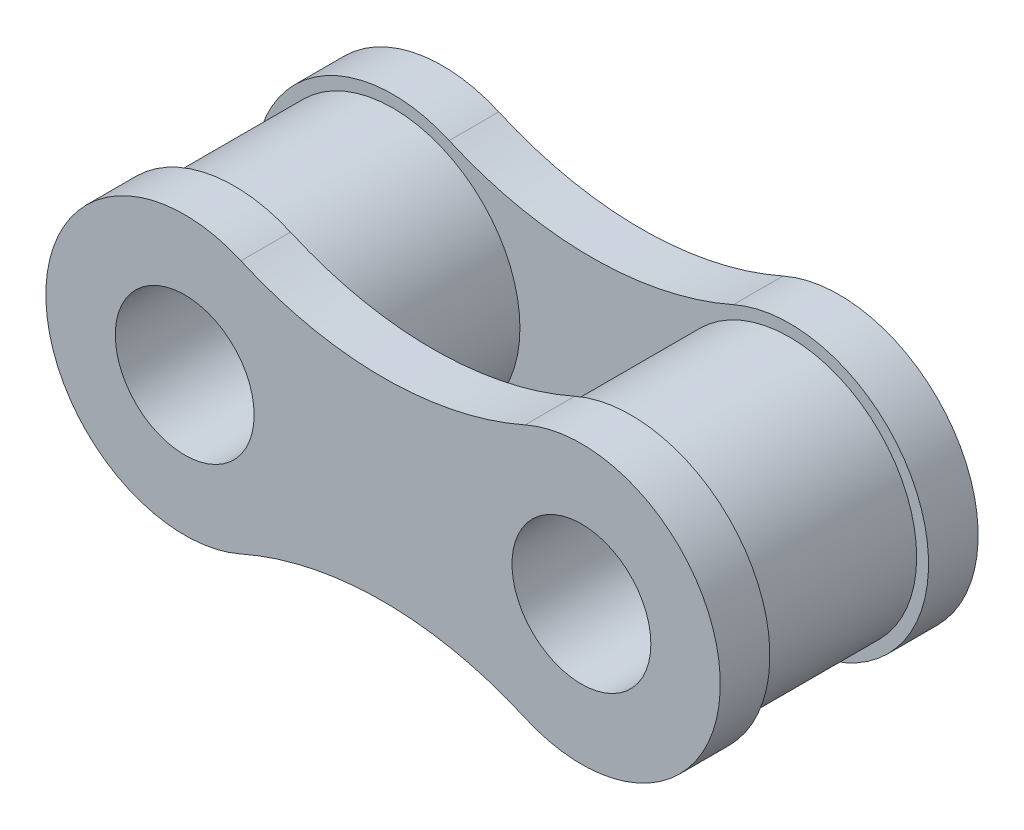
ISO-10303-21;
HEADER;
FILE_DESCRIPTION(('STEP AP214'),'2;1');
FILE_NAME('part.step','',(''),(''),'','','');
FILE_SCHEMA(('AUTOMOTIVE_DESIGN { 1 0 10303 214 1 1 1 1 }'));
ENDSEC;
DATA;
#1=APPLICATION_CONTEXT('core data for automotive mechanical design processes');
#2=APPLICATION_PROTOCOL_DEFINITION('international standard','automotive_design',2000,#1);
#3=PRODUCT_CONTEXT('',#1,'mechanical');
#4=PRODUCT('Part','Part','',(#3));
#5=PRODUCT_RELATED_PRODUCT_CATEGORY('part','',(#4));
#6=PRODUCT_DEFINITION_FORMATION('','',#4);
#7=PRODUCT_DEFINITION_CONTEXT('part definition',#1,'design');
#8=PRODUCT_DEFINITION('design','',#6,#7);
#9=PRODUCT_DEFINITION_SHAPE('','',#8);
#10=(LENGTH_UNIT() NAMED_UNIT(*) SI_UNIT(.MILLI.,.METRE.));
#11=(NAMED_UNIT(*) PLANE_ANGLE_UNIT() SI_UNIT($,.RADIAN.));
#12=(NAMED_UNIT(*) SI_UNIT($,.STERADIAN.) SOLID_ANGLE_UNIT());
#13=UNCERTAINTY_MEASURE_WITH_UNIT(LENGTH_MEASURE(1.E-05),#10,'distance_accuracy_value','');
#14=(GEOMETRIC_REPRESENTATION_CONTEXT(3) GLOBAL_UNCERTAINTY_ASSIGNED_CONTEXT((#13)) GLOBAL_UNIT_ASSIGNED_CONTEXT((#10,
#11,#12)) REPRESENTATION_CONTEXT('',''));
#15=CARTESIAN_POINT('',(0.,0.,0.));
#16=DIRECTION('',(0.,0.,1.));
#17=DIRECTION('',(1.,0.,0.));
#18=AXIS2_PLACEMENT_3D('',#15,#16,#17);
#19=CARTESIAN_POINT('',(11.90625,8.95788932140425,-3.175));
#20=DIRECTION('',(0.,0.,-1.));
#21=DIRECTION('',(1.,0.,0.));
#22=AXIS2_PLACEMENT_3D('',#19,#20,#21);
#23=PLANE('',#22);
#24=CARTESIAN_POINT('',(0.,0.,-3.17499999999882));
#25=DIRECTION('',(0.,0.,-1.));
#26=DIRECTION('',(-1.,0.,0.));
#27=AXIS2_PLACEMENT_3D('',#24,#25,#26);
#28=CIRCLE('',#27,3.81);
#29=CARTESIAN_POINT('',(-3.81,0.,-3.17499999999882));
#30=VERTEX_POINT('',#29);
#31=EDGE_CURVE('E191',#30,#30,#28,.F.);
#32=ORIENTED_EDGE('',*,*,#31,.F.);
#33=EDGE_LOOP('',(#32));
#34=FACE_BOUND('',#33,.T.);
#35=CARTESIAN_POINT('',(7.9375,17.9157786428085,-3.175));
#36=DIRECTION('',(0.,0.,-1.));
#37=DIRECTION('',(1.,0.,0.));
#38=AXIS2_PLACEMENT_3D('',#35,#36,#37);
#39=CIRCLE('',#38,14.0391328905718);
#40=CARTESIAN_POINT('',(13.6243303079972,5.08000000000001,-3.175));
#41=VERTEX_POINT('',#40);
#42=CARTESIAN_POINT('',(2.25066969200279,5.08000000000001,-3.175));
#43=VERTEX_POINT('',#42);
#44=EDGE_CURVE('E167',#41,#43,#39,.T.);
#45=ORIENTED_EDGE('',*,*,#44,.T.);
#46=CARTESIAN_POINT('',(0.,0.,-3.175));
#47=DIRECTION('',(0.,0.,1.));
#48=DIRECTION('',(1.,0.,0.));
#49=AXIS2_PLACEMENT_3D('',#46,#47,#48);
#50=CIRCLE('',#49,5.55625);
#51=CARTESIAN_POINT('',(2.25066969200279,-5.08000000000001,-3.175));
#52=VERTEX_POINT('',#51);
#53=EDGE_CURVE('E179',#43,#52,#50,.T.);
#54=ORIENTED_EDGE('',*,*,#53,.T.);
#55=CARTESIAN_POINT('',(7.9375,-17.9157786428085,-3.175));
#56=DIRECTION('',(0.,0.,-1.));
#57=DIRECTION('',(-1.,0.,0.));
#58=AXIS2_PLACEMENT_3D('',#55,#56,#57);
#59=CIRCLE('',#58,14.0391328905718);
#60=CARTESIAN_POINT('',(13.6243303079972,-5.08,-3.175));
#61=VERTEX_POINT('',#60);
#62=EDGE_CURVE('E182',#52,#61,#59,.T.);
#63=ORIENTED_EDGE('',*,*,#62,.T.);
#64=CARTESIAN_POINT('',(15.875,0.,-3.175));
#65=DIRECTION('',(0.,0.,1.));
#66=DIRECTION('',(1.,0.,0.));
#67=AXIS2_PLACEMENT_3D('',#64,#65,#66);
#68=CIRCLE('',#67,5.55625);
#69=EDGE_CURVE('E171',#61,#41,#68,.T.);
#70=ORIENTED_EDGE('',*,*,#69,.T.);
#71=EDGE_LOOP('',(#45,#54,#63,#70));
#72=FACE_BOUND('',#71,.T.);
#73=CARTESIAN_POINT('',(15.875,0.,-3.17499999999882));
#74=DIRECTION('',(0.,0.,-1.));
#75=DIRECTION('',(-1.,0.,0.));
#76=AXIS2_PLACEMENT_3D('',#73,#74,#75);
#77=CIRCLE('',#76,3.81);
#78=CARTESIAN_POINT('',(12.065,0.,-3.17499999999882));
#79=VERTEX_POINT('',#78);
#80=EDGE_CURVE('E13',#79,#79,#77,.F.);
#81=ORIENTED_EDGE('',*,*,#80,.F.);
#82=EDGE_LOOP('',(#81));
#83=FACE_BOUND('',#82,.T.);
#84=ADVANCED_FACE('F53',(#34,#72,#83),#23,.F.);
#85=CARTESIAN_POINT('',(11.90625,8.95788932140425,3.175));
#86=DIRECTION('',(0.,0.,1.));
#87=DIRECTION('',(1.,0.,0.));
#88=AXIS2_PLACEMENT_3D('',#85,#86,#87);
#89=PLANE('',#88);
#90=CARTESIAN_POINT('',(0.,0.,3.17499999999882));
#91=DIRECTION('',(0.,0.,1.));
#92=DIRECTION('',(1.,0.,0.));
#93=AXIS2_PLACEMENT_3D('',#90,#91,#92);
#94=CIRCLE('',#93,3.81);
#95=CARTESIAN_POINT('',(3.81,0.,3.17499999999882));
#96=VERTEX_POINT('',#95);
#97=EDGE_CURVE('E153',#96,#96,#94,.T.);
#98=ORIENTED_EDGE('',*,*,#97,.T.);
#99=EDGE_LOOP('',(#98));
#100=FACE_BOUND('',#99,.T.);
#101=CARTESIAN_POINT('',(7.9375,17.9157786428085,3.175));
#102=DIRECTION('',(0.,0.,-1.));
#103=DIRECTION('',(1.,0.,0.));
#104=AXIS2_PLACEMENT_3D('',#101,#102,#103);
#105=CIRCLE('',#104,14.0391328905718);
#106=CARTESIAN_POINT('',(13.6243303079972,5.08000000000001,3.175));
#107=VERTEX_POINT('',#106);
#108=CARTESIAN_POINT('',(2.25066969200279,5.08000000000001,3.175));
#109=VERTEX_POINT('',#108);
#110=EDGE_CURVE('E152',#107,#109,#105,.T.);
#111=ORIENTED_EDGE('',*,*,#110,.F.);
#112=CARTESIAN_POINT('',(15.875,0.,3.175));
#113=DIRECTION('',(0.,0.,1.));
#114=DIRECTION('',(1.,0.,0.));
#115=AXIS2_PLACEMENT_3D('',#112,#113,#114);
#116=CIRCLE('',#115,5.55625);
#117=CARTESIAN_POINT('',(13.6243303079972,-5.08,3.175));
#118=VERTEX_POINT('',#117);
#119=EDGE_CURVE('E148',#118,#107,#116,.T.);
#120=ORIENTED_EDGE('',*,*,#119,.F.);
#121=CARTESIAN_POINT('',(7.9375,-17.9157786428085,3.175));
#122=DIRECTION('',(0.,0.,-1.));
#123=DIRECTION('',(-1.,0.,0.));
#124=AXIS2_PLACEMENT_3D('',#121,#122,#123);
#125=CIRCLE('',#124,14.0391328905718);
#126=CARTESIAN_POINT('',(2.25066969200279,-5.08000000000001,3.175));
#127=VERTEX_POINT('',#126);
#128=EDGE_CURVE('E272',#127,#118,#125,.T.);
#129=ORIENTED_EDGE('',*,*,#128,.F.);
#130=CARTESIAN_POINT('',(0.,0.,3.175));
#131=DIRECTION('',(0.,0.,1.));
#132=DIRECTION('',(1.,0.,0.));
#133=AXIS2_PLACEMENT_3D('',#130,#131,#132);
#134=CIRCLE('',#133,5.55625);
#135=EDGE_CURVE('E270',#109,#127,#134,.T.);
#136=ORIENTED_EDGE('',*,*,#135,.F.);
#137=EDGE_LOOP('',(#111,#120,#129,#136));
#138=FACE_BOUND('',#137,.T.);
#139=CARTESIAN_POINT('',(15.875,0.,3.17499999999882));
#140=DIRECTION('',(0.,0.,1.));
#141=DIRECTION('',(1.,0.,0.));
#142=AXIS2_PLACEMENT_3D('',#139,#140,#141);
#143=CIRCLE('',#142,3.81);
#144=CARTESIAN_POINT('',(19.685,0.,3.17499999999882));
#145=VERTEX_POINT('',#144);
#146=EDGE_CURVE('E62',#145,#145,#143,.F.);
#147=ORIENTED_EDGE('',*,*,#146,.F.);
#148=EDGE_LOOP('',(#147));
#149=FACE_BOUND('',#148,.T.);
#150=ADVANCED_FACE('F198',(#100,#138,#149),#89,.F.);
#151=CARTESIAN_POINT('',(11.90625,8.95788932140425,-5.159375));
#152=DIRECTION('',(0.,0.,-1.));
#153=DIRECTION('',(1.,0.,0.));
#154=AXIS2_PLACEMENT_3D('',#151,#152,#153);
#155=PLANE('',#154);
#156=CARTESIAN_POINT('',(0.,0.,-5.159375));
#157=DIRECTION('',(0.,0.,1.));
#158=DIRECTION('',(1.,0.,0.));
#159=AXIS2_PLACEMENT_3D('',#156,#157,#158);
#160=CIRCLE('',#159,2.778125);
#161=CARTESIAN_POINT('',(2.778125,0.,-5.159375));
#162=VERTEX_POINT('',#161);
#163=EDGE_CURVE('E164',#162,#162,#160,.T.);
#164=ORIENTED_EDGE('',*,*,#163,.T.);
#165=EDGE_LOOP('',(#164));
#166=FACE_BOUND('',#165,.T.);
#167=CARTESIAN_POINT('',(7.9375,17.9157786428085,-5.159375));
#168=DIRECTION('',(0.,0.,-1.));
#169=DIRECTION('',(1.,0.,0.));
#170=AXIS2_PLACEMENT_3D('',#167,#168,#169);
#171=CIRCLE('',#170,14.0391328905718);
#172=CARTESIAN_POINT('',(13.6243303079972,5.08000000000001,-5.159375));
#173=VERTEX_POINT('',#172);
#174=CARTESIAN_POINT('',(2.25066969200279,5.08000000000001,-5.159375));
#175=VERTEX_POINT('',#174);
#176=EDGE_CURVE('E168',#173,#175,#171,.T.);
#177=ORIENTED_EDGE('',*,*,#176,.F.);
#178=CARTESIAN_POINT('',(15.875,0.,-5.159375));
#179=DIRECTION('',(0.,0.,1.));
#180=DIRECTION('',(1.,0.,0.));
#181=AXIS2_PLACEMENT_3D('',#178,#179,#180);
#182=CIRCLE('',#181,5.55625);
#183=CARTESIAN_POINT('',(13.6243303079972,-5.08,-5.159375));
#184=VERTEX_POINT('',#183);
#185=EDGE_CURVE('E175',#184,#173,#182,.T.);
#186=ORIENTED_EDGE('',*,*,#185,.F.);
#187=CARTESIAN_POINT('',(7.9375,-17.9157786428085,-5.159375));
#188=DIRECTION('',(0.,0.,-1.));
#189=DIRECTION('',(-1.,0.,0.));
#190=AXIS2_PLACEMENT_3D('',#187,#188,#189);
#191=CIRCLE('',#190,14.0391328905718);
#192=CARTESIAN_POINT('',(2.25066969200279,-5.08000000000001,-5.159375));
#193=VERTEX_POINT('',#192);
#194=EDGE_CURVE('E173',#193,#184,#191,.T.);
#195=ORIENTED_EDGE('',*,*,#194,.F.);
#196=CARTESIAN_POINT('',(0.,0.,-5.159375));
#197=DIRECTION('',(0.,0.,1.));
#198=DIRECTION('',(1.,0.,0.));
#199=AXIS2_PLACEMENT_3D('',#196,#197,#198);
#200=CIRCLE('',#199,5.55625);
#201=EDGE_CURVE('E170',#175,#193,#200,.T.);
#202=ORIENTED_EDGE('',*,*,#201,.F.);
#203=EDGE_LOOP('',(#177,#186,#195,#202));
#204=FACE_BOUND('',#203,.T.);
#205=CARTESIAN_POINT('',(15.875,0.,-5.159375));
#206=DIRECTION('',(0.,0.,1.));
#207=DIRECTION('',(1.,0.,0.));
#208=AXIS2_PLACEMENT_3D('',#205,#206,#207);
#209=CIRCLE('',#208,2.778125);
#210=CARTESIAN_POINT('',(18.653125,0.,-5.159375));
#211=VERTEX_POINT('',#210);
#212=EDGE_CURVE('E156',#211,#211,#209,.T.);
#213=ORIENTED_EDGE('',*,*,#212,.T.);
#214=EDGE_LOOP('',(#213));
#215=FACE_BOUND('',#214,.T.);
#216=ADVANCED_FACE('F200',(#166,#204,#215),#155,.T.);
#217=CARTESIAN_POINT('',(7.9375,17.9157786428085,-5.159375));
#218=DIRECTION('',(0.,0.,1.));
#219=DIRECTION('',(-1.,0.,0.));
#220=AXIS2_PLACEMENT_3D('',#217,#218,#219);
#221=CYLINDRICAL_SURFACE('',#220,14.0391328905718);
#222=ORIENTED_EDGE('',*,*,#44,.F.);
#223=DIRECTION('',(0.,0.,1.));
#224=VECTOR('',#223,1.);
#225=CARTESIAN_POINT('',(13.6243303079972,5.08000000000001,-5.159375));
#226=LINE('',#225,#224);
#227=EDGE_CURVE('E70',#173,#41,#226,.T.);
#228=ORIENTED_EDGE('',*,*,#227,.F.);
#229=ORIENTED_EDGE('',*,*,#176,.T.);
#230=DIRECTION('',(0.,0.,1.));
#231=VECTOR('',#230,1.);
#232=CARTESIAN_POINT('',(2.25066969200279,5.08000000000001,-5.159375));
#233=LINE('',#232,#231);
#234=EDGE_CURVE('E98',#175,#43,#233,.T.);
#235=ORIENTED_EDGE('',*,*,#234,.T.);
#236=EDGE_LOOP('',(#222,#228,#229,#235));
#237=FACE_BOUND('',#236,.T.);
#238=ADVANCED_FACE('F55',(#237),#221,.F.);
#239=CARTESIAN_POINT('',(0.,0.,-5.159375));
#240=DIRECTION('',(0.,0.,1.));
#241=DIRECTION('',(-1.,0.,0.));
#242=AXIS2_PLACEMENT_3D('',#239,#240,#241);
#243=CYLINDRICAL_SURFACE('',#242,5.55625);
#244=ORIENTED_EDGE('',*,*,#53,.F.);
#245=ORIENTED_EDGE('',*,*,#234,.F.);
#246=ORIENTED_EDGE('',*,*,#201,.T.);
#247=DIRECTION('',(0.,0.,1.));
#248=VECTOR('',#247,1.);
#249=CARTESIAN_POINT('',(2.25066969200279,-5.08000000000001,-5.159375));
#250=LINE('',#249,#248);
#251=EDGE_CURVE('E188',#193,#52,#250,.T.);
#252=ORIENTED_EDGE('',*,*,#251,.T.);
#253=EDGE_LOOP('',(#244,#245,#246,#252));
#254=FACE_BOUND('',#253,.T.);
#255=ADVANCED_FACE('F244',(#254),#243,.T.);
#256=CARTESIAN_POINT('',(7.9375,-17.9157786428085,-5.159375));
#257=DIRECTION('',(0.,0.,1.));
#258=DIRECTION('',(-1.,0.,0.));
#259=AXIS2_PLACEMENT_3D('',#256,#257,#258);
#260=CYLINDRICAL_SURFACE('',#259,14.0391328905718);
#261=ORIENTED_EDGE('',*,*,#62,.F.);
#262=ORIENTED_EDGE('',*,*,#251,.F.);
#263=ORIENTED_EDGE('',*,*,#194,.T.);
#264=DIRECTION('',(0.,0.,1.));
#265=VECTOR('',#264,1.);
#266=CARTESIAN_POINT('',(13.6243303079972,-5.08,-5.159375));
#267=LINE('',#266,#265);
#268=EDGE_CURVE('E88',#184,#61,#267,.T.);
#269=ORIENTED_EDGE('',*,*,#268,.T.);
#270=EDGE_LOOP('',(#261,#262,#263,#269));
#271=FACE_BOUND('',#270,.T.);
#272=ADVANCED_FACE('F242',(#271),#260,.F.);
#273=CARTESIAN_POINT('',(15.875,0.,-5.159375));
#274=DIRECTION('',(0.,0.,1.));
#275=DIRECTION('',(-1.,0.,0.));
#276=AXIS2_PLACEMENT_3D('',#273,#274,#275);
#277=CYLINDRICAL_SURFACE('',#276,5.55625);
#278=ORIENTED_EDGE('',*,*,#69,.F.);
#279=ORIENTED_EDGE('',*,*,#268,.F.);
#280=ORIENTED_EDGE('',*,*,#185,.T.);
#281=ORIENTED_EDGE('',*,*,#227,.T.);
#282=EDGE_LOOP('',(#278,#279,#280,#281));
#283=FACE_BOUND('',#282,.T.);
#284=ADVANCED_FACE('F237',(#283),#277,.T.);
#285=CARTESIAN_POINT('',(0.,0.,-5.159375));
#286=DIRECTION('',(0.,0.,1.));
#287=DIRECTION('',(-1.,0.,0.));
#288=AXIS2_PLACEMENT_3D('',#285,#286,#287);
#289=CYLINDRICAL_SURFACE('',#288,2.778125);
#290=ORIENTED_EDGE('',*,*,#163,.F.);
#291=EDGE_LOOP('',(#290));
#292=FACE_BOUND('',#291,.T.);
#293=CARTESIAN_POINT('',(0.,0.,5.159375));
#294=DIRECTION('',(0.,0.,1.));
#295=DIRECTION('',(1.,0.,0.));
#296=AXIS2_PLACEMENT_3D('',#293,#294,#295);
#297=CIRCLE('',#296,2.778125);
#298=CARTESIAN_POINT('',(2.778125,0.,5.159375));
#299=VERTEX_POINT('',#298);
#300=EDGE_CURVE('E261',#299,#299,#297,.T.);
#301=ORIENTED_EDGE('',*,*,#300,.T.);
#302=EDGE_LOOP('',(#301));
#303=FACE_BOUND('',#302,.T.);
#304=ADVANCED_FACE('F234',(#292,#303),#289,.F.);
#305=CARTESIAN_POINT('',(15.875,0.,-5.159375));
#306=DIRECTION('',(0.,0.,1.));
#307=DIRECTION('',(-1.,0.,0.));
#308=AXIS2_PLACEMENT_3D('',#305,#306,#307);
#309=CYLINDRICAL_SURFACE('',#308,2.778125);
#310=ORIENTED_EDGE('',*,*,#212,.F.);
#311=EDGE_LOOP('',(#310));
#312=FACE_BOUND('',#311,.T.);
#313=CARTESIAN_POINT('',(15.875,0.,5.159375));
#314=DIRECTION('',(0.,0.,1.));
#315=DIRECTION('',(1.,0.,0.));
#316=AXIS2_PLACEMENT_3D('',#313,#314,#315);
#317=CIRCLE('',#316,2.778125);
#318=CARTESIAN_POINT('',(18.653125,0.,5.159375));
#319=VERTEX_POINT('',#318);
#320=EDGE_CURVE('E260',#319,#319,#317,.T.);
#321=ORIENTED_EDGE('',*,*,#320,.T.);
#322=EDGE_LOOP('',(#321));
#323=FACE_BOUND('',#322,.T.);
#324=ADVANCED_FACE('F230',(#312,#323),#309,.F.);
#325=CARTESIAN_POINT('',(0.,0.,500000.));
#326=DIRECTION('',(0.,0.,-1.));
#327=DIRECTION('',(-1.,0.,0.));
#328=AXIS2_PLACEMENT_3D('',#325,#326,#327);
#329=CYLINDRICAL_SURFACE('',#328,3.81);
#330=ORIENTED_EDGE('',*,*,#31,.T.);
#331=EDGE_LOOP('',(#330));
#332=FACE_BOUND('',#331,.T.);
#333=ORIENTED_EDGE('',*,*,#97,.F.);
#334=EDGE_LOOP('',(#333));
#335=FACE_BOUND('',#334,.T.);
#336=ADVANCED_FACE('F227',(#332,#335),#329,.T.);
#337=CARTESIAN_POINT('',(11.90625,8.95788932140425,5.159375));
#338=DIRECTION('',(0.,0.,1.));
#339=DIRECTION('',(1.,0.,0.));
#340=AXIS2_PLACEMENT_3D('',#337,#338,#339);
#341=PLANE('',#340);
#342=ORIENTED_EDGE('',*,*,#300,.F.);
#343=EDGE_LOOP('',(#342));
#344=FACE_BOUND('',#343,.T.);
#345=CARTESIAN_POINT('',(7.9375,17.9157786428085,5.159375));
#346=DIRECTION('',(0.,0.,-1.));
#347=DIRECTION('',(1.,0.,0.));
#348=AXIS2_PLACEMENT_3D('',#345,#346,#347);
#349=CIRCLE('',#348,14.0391328905718);
#350=CARTESIAN_POINT('',(13.6243303079972,5.08000000000001,5.159375));
#351=VERTEX_POINT('',#350);
#352=CARTESIAN_POINT('',(2.25066969200279,5.08000000000001,5.159375));
#353=VERTEX_POINT('',#352);
#354=EDGE_CURVE('E138',#351,#353,#349,.T.);
#355=ORIENTED_EDGE('',*,*,#354,.T.);
#356=CARTESIAN_POINT('',(0.,0.,5.159375));
#357=DIRECTION('',(0.,0.,1.));
#358=DIRECTION('',(1.,0.,0.));
#359=AXIS2_PLACEMENT_3D('',#356,#357,#358);
#360=CIRCLE('',#359,5.55625);
#361=CARTESIAN_POINT('',(2.25066969200279,-5.08000000000001,5.159375));
#362=VERTEX_POINT('',#361);
#363=EDGE_CURVE('E127',#353,#362,#360,.T.);
#364=ORIENTED_EDGE('',*,*,#363,.T.);
#365=CARTESIAN_POINT('',(7.9375,-17.9157786428085,5.159375));
#366=DIRECTION('',(0.,0.,-1.));
#367=DIRECTION('',(-1.,0.,0.));
#368=AXIS2_PLACEMENT_3D('',#365,#366,#367);
#369=CIRCLE('',#368,14.0391328905718);
#370=CARTESIAN_POINT('',(13.6243303079972,-5.08,5.159375));
#371=VERTEX_POINT('',#370);
#372=EDGE_CURVE('E137',#362,#371,#369,.T.);
#373=ORIENTED_EDGE('',*,*,#372,.T.);
#374=CARTESIAN_POINT('',(15.875,0.,5.159375));
#375=DIRECTION('',(0.,0.,1.));
#376=DIRECTION('',(1.,0.,0.));
#377=AXIS2_PLACEMENT_3D('',#374,#375,#376);
#378=CIRCLE('',#377,5.55625);
#379=EDGE_CURVE('E144',#371,#351,#378,.T.);
#380=ORIENTED_EDGE('',*,*,#379,.T.);
#381=EDGE_LOOP('',(#355,#364,#373,#380));
#382=FACE_BOUND('',#381,.T.);
#383=ORIENTED_EDGE('',*,*,#320,.F.);
#384=EDGE_LOOP('',(#383));
#385=FACE_BOUND('',#384,.T.);
#386=ADVANCED_FACE('F141',(#344,#382,#385),#341,.T.);
#387=CARTESIAN_POINT('',(7.9375,17.9157786428085,5.159375));
#388=DIRECTION('',(0.,0.,-1.));
#389=DIRECTION('',(-1.,0.,0.));
#390=AXIS2_PLACEMENT_3D('',#387,#388,#389);
#391=CYLINDRICAL_SURFACE('',#390,14.0391328905718);
#392=ORIENTED_EDGE('',*,*,#110,.T.);
#393=DIRECTION('',(0.,0.,-1.));
#394=VECTOR('',#393,1.);
#395=CARTESIAN_POINT('',(2.25066969200279,5.08000000000001,5.159375));
#396=LINE('',#395,#394);
#397=EDGE_CURVE('E131',#353,#109,#396,.T.);
#398=ORIENTED_EDGE('',*,*,#397,.F.);
#399=ORIENTED_EDGE('',*,*,#354,.F.);
#400=DIRECTION('',(0.,0.,-1.));
#401=VECTOR('',#400,1.);
#402=CARTESIAN_POINT('',(13.6243303079972,5.08000000000001,5.159375));
#403=LINE('',#402,#401);
#404=EDGE_CURVE('E268',#351,#107,#403,.T.);
#405=ORIENTED_EDGE('',*,*,#404,.T.);
#406=EDGE_LOOP('',(#392,#398,#399,#405));
#407=FACE_BOUND('',#406,.T.);
#408=ADVANCED_FACE('F150',(#407),#391,.F.);
#409=CARTESIAN_POINT('',(0.,0.,5.159375));
#410=DIRECTION('',(0.,0.,-1.));
#411=DIRECTION('',(-1.,0.,0.));
#412=AXIS2_PLACEMENT_3D('',#409,#410,#411);
#413=CYLINDRICAL_SURFACE('',#412,5.55625);
#414=ORIENTED_EDGE('',*,*,#135,.T.);
#415=DIRECTION('',(0.,0.,-1.));
#416=VECTOR('',#415,1.);
#417=CARTESIAN_POINT('',(2.25066969200279,-5.08000000000001,5.159375));
#418=LINE('',#417,#416);
#419=EDGE_CURVE('E134',#362,#127,#418,.T.);
#420=ORIENTED_EDGE('',*,*,#419,.F.);
#421=ORIENTED_EDGE('',*,*,#363,.F.);
#422=ORIENTED_EDGE('',*,*,#397,.T.);
#423=EDGE_LOOP('',(#414,#420,#421,#422));
#424=FACE_BOUND('',#423,.T.);
#425=ADVANCED_FACE('F129',(#424),#413,.T.);
#426=CARTESIAN_POINT('',(7.9375,-17.9157786428085,5.159375));
#427=DIRECTION('',(0.,0.,-1.));
#428=DIRECTION('',(-1.,0.,0.));
#429=AXIS2_PLACEMENT_3D('',#426,#427,#428);
#430=CYLINDRICAL_SURFACE('',#429,14.0391328905718);
#431=ORIENTED_EDGE('',*,*,#128,.T.);
#432=DIRECTION('',(0.,0.,-1.));
#433=VECTOR('',#432,1.);
#434=CARTESIAN_POINT('',(13.6243303079972,-5.08,5.159375));
#435=LINE('',#434,#433);
#436=EDGE_CURVE('E158',#371,#118,#435,.T.);
#437=ORIENTED_EDGE('',*,*,#436,.F.);
#438=ORIENTED_EDGE('',*,*,#372,.F.);
#439=ORIENTED_EDGE('',*,*,#419,.T.);
#440=EDGE_LOOP('',(#431,#437,#438,#439));
#441=FACE_BOUND('',#440,.T.);
#442=ADVANCED_FACE('F218',(#441),#430,.F.);
#443=CARTESIAN_POINT('',(15.875,0.,5.159375));
#444=DIRECTION('',(0.,0.,-1.));
#445=DIRECTION('',(-1.,0.,0.));
#446=AXIS2_PLACEMENT_3D('',#443,#444,#445);
#447=CYLINDRICAL_SURFACE('',#446,5.55625);
#448=ORIENTED_EDGE('',*,*,#119,.T.);
#449=ORIENTED_EDGE('',*,*,#404,.F.);
#450=ORIENTED_EDGE('',*,*,#379,.F.);
#451=ORIENTED_EDGE('',*,*,#436,.T.);
#452=EDGE_LOOP('',(#448,#449,#450,#451));
#453=FACE_BOUND('',#452,.T.);
#454=ADVANCED_FACE('F215',(#453),#447,.T.);
#455=CARTESIAN_POINT('',(15.875,0.,500000.));
#456=DIRECTION('',(0.,0.,-1.));
#457=DIRECTION('',(-1.,0.,0.));
#458=AXIS2_PLACEMENT_3D('',#455,#456,#457);
#459=CYLINDRICAL_SURFACE('',#458,3.81);
#460=ORIENTED_EDGE('',*,*,#80,.T.);
#461=EDGE_LOOP('',(#460));
#462=FACE_BOUND('',#461,.T.);
#463=ORIENTED_EDGE('',*,*,#146,.T.);
#464=EDGE_LOOP('',(#463));
#465=FACE_BOUND('',#464,.T.);
#466=ADVANCED_FACE('F196',(#462,#465),#459,.T.);
#467=CLOSED_SHELL('',(#84,#150,#216,#238,#255,#272,#284,#304,#324,#336,#386,#408,#425,#442,#454,#466));
#468=MANIFOLD_SOLID_BREP('B2',#467);
#469=CARTESIAN_POINT('',(15.875,0.,3.175));
#470=DIRECTION('',(0.,0.,1.));
#471=DIRECTION('',(1.,0.,0.));
#472=AXIS2_PLACEMENT_3D('',#469,#470,#471);
#473=PLANE('',#472);
#474=CARTESIAN_POINT('',(15.875,0.,3.175));
#475=DIRECTION('',(0.,0.,1.));
#476=DIRECTION('',(1.,0.,0.));
#477=AXIS2_PLACEMENT_3D('',#474,#475,#476);
#478=CIRCLE('',#477,5.08);
#479=CARTESIAN_POINT('',(20.955,0.,3.175));
#480=VERTEX_POINT('',#479);
#481=EDGE_CURVE('E52',#480,#480,#478,.T.);
#482=ORIENTED_EDGE('',*,*,#481,.T.);
#483=EDGE_LOOP('',(#482));
#484=FACE_BOUND('',#483,.T.);
#485=CARTESIAN_POINT('',(15.875,0.,3.175));
#486=DIRECTION('',(0.,0.,1.));
#487=DIRECTION('',(1.,0.,0.));
#488=AXIS2_PLACEMENT_3D('',#485,#486,#487);
#489=CIRCLE('',#488,3.81);
#490=CARTESIAN_POINT('',(19.685,0.,3.175));
#491=VERTEX_POINT('',#490);
#492=EDGE_CURVE('E426',#491,#491,#489,.T.);
#493=ORIENTED_EDGE('',*,*,#492,.F.);
#494=EDGE_LOOP('',(#493));
#495=FACE_BOUND('',#494,.T.);
#496=ADVANCED_FACE('F415',(#484,#495),#473,.T.);
#497=CARTESIAN_POINT('',(15.875,0.,-3.175));
#498=DIRECTION('',(0.,0.,1.));
#499=DIRECTION('',(1.,0.,0.));
#500=AXIS2_PLACEMENT_3D('',#497,#498,#499);
#501=PLANE('',#500);
#502=CARTESIAN_POINT('',(15.875,0.,-3.175));
#503=DIRECTION('',(0.,0.,1.));
#504=DIRECTION('',(1.,0.,0.));
#505=AXIS2_PLACEMENT_3D('',#502,#503,#504);
#506=CIRCLE('',#505,5.08);
#507=CARTESIAN_POINT('',(20.955,0.,-3.175));
#508=VERTEX_POINT('',#507);
#509=EDGE_CURVE('E419',#508,#508,#506,.T.);
#510=ORIENTED_EDGE('',*,*,#509,.F.);
#511=EDGE_LOOP('',(#510));
#512=FACE_BOUND('',#511,.T.);
#513=CARTESIAN_POINT('',(15.875,0.,-3.175));
#514=DIRECTION('',(0.,0.,1.));
#515=DIRECTION('',(1.,0.,0.));
#516=AXIS2_PLACEMENT_3D('',#513,#514,#515);
#517=CIRCLE('',#516,3.81);
#518=CARTESIAN_POINT('',(19.685,0.,-3.175));
#519=VERTEX_POINT('',#518);
#520=EDGE_CURVE('E428',#519,#519,#517,.T.);
#521=ORIENTED_EDGE('',*,*,#520,.T.);
#522=EDGE_LOOP('',(#521));
#523=FACE_BOUND('',#522,.T.);
#524=ADVANCED_FACE('F438',(#512,#523),#501,.F.);
#525=CARTESIAN_POINT('',(15.875,0.,3.175));
#526=DIRECTION('',(0.,0.,-1.));
#527=DIRECTION('',(-1.,0.,0.));
#528=AXIS2_PLACEMENT_3D('',#525,#526,#527);
#529=CYLINDRICAL_SURFACE('',#528,5.08);
#530=ORIENTED_EDGE('',*,*,#481,.F.);
#531=EDGE_LOOP('',(#530));
#532=FACE_BOUND('',#531,.T.);
#533=ORIENTED_EDGE('',*,*,#509,.T.);
#534=EDGE_LOOP('',(#533));
#535=FACE_BOUND('',#534,.T.);
#536=ADVANCED_FACE('F417',(#532,#535),#529,.T.);
#537=CARTESIAN_POINT('',(15.875,0.,3.175));
#538=DIRECTION('',(0.,0.,-1.));
#539=DIRECTION('',(-1.,0.,0.));
#540=AXIS2_PLACEMENT_3D('',#537,#538,#539);
#541=CYLINDRICAL_SURFACE('',#540,3.81);
#542=ORIENTED_EDGE('',*,*,#492,.T.);
#543=EDGE_LOOP('',(#542));
#544=FACE_BOUND('',#543,.T.);
#545=ORIENTED_EDGE('',*,*,#520,.F.);
#546=EDGE_LOOP('',(#545));
#547=FACE_BOUND('',#546,.T.);
#548=ADVANCED_FACE('F434',(#544,#547),#541,.F.);
#549=CLOSED_SHELL('',(#496,#524,#536,#548));
#550=MANIFOLD_SOLID_BREP('B7',#549);
#551=CARTESIAN_POINT('',(0.,0.,3.175));
#552=DIRECTION('',(0.,0.,1.));
#553=DIRECTION('',(1.,0.,0.));
#554=AXIS2_PLACEMENT_3D('',#551,#552,#553);
#555=PLANE('',#554);
#556=CARTESIAN_POINT('',(0.,0.,3.175));
#557=DIRECTION('',(0.,0.,1.));
#558=DIRECTION('',(1.,0.,0.));
#559=AXIS2_PLACEMENT_3D('',#556,#557,#558);
#560=CIRCLE('',#559,5.08);
#561=CARTESIAN_POINT('',(5.08,0.,3.175));
#562=VERTEX_POINT('',#561);
#563=EDGE_CURVE('E414',#562,#562,#560,.T.);
#564=ORIENTED_EDGE('',*,*,#563,.T.);
#565=EDGE_LOOP('',(#564));
#566=FACE_BOUND('',#565,.T.);
#567=CARTESIAN_POINT('',(0.,0.,3.175));
#568=DIRECTION('',(0.,0.,1.));
#569=DIRECTION('',(1.,0.,0.));
#570=AXIS2_PLACEMENT_3D('',#567,#568,#569);
#571=CIRCLE('',#570,3.81);
#572=CARTESIAN_POINT('',(3.81,0.,3.175));
#573=VERTEX_POINT('',#572);
#574=EDGE_CURVE('E487',#573,#573,#571,.T.);
#575=ORIENTED_EDGE('',*,*,#574,.F.);
#576=EDGE_LOOP('',(#575));
#577=FACE_BOUND('',#576,.T.);
#578=ADVANCED_FACE('F476',(#566,#577),#555,.T.);
#579=CARTESIAN_POINT('',(0.,0.,-3.175));
#580=DIRECTION('',(0.,0.,1.));
#581=DIRECTION('',(1.,0.,0.));
#582=AXIS2_PLACEMENT_3D('',#579,#580,#581);
#583=PLANE('',#582);
#584=CARTESIAN_POINT('',(0.,0.,-3.175));
#585=DIRECTION('',(0.,0.,1.));
#586=DIRECTION('',(1.,0.,0.));
#587=AXIS2_PLACEMENT_3D('',#584,#585,#586);
#588=CIRCLE('',#587,5.08);
#589=CARTESIAN_POINT('',(5.08,0.,-3.175));
#590=VERTEX_POINT('',#589);
#591=EDGE_CURVE('E480',#590,#590,#588,.T.);
#592=ORIENTED_EDGE('',*,*,#591,.F.);
#593=EDGE_LOOP('',(#592));
#594=FACE_BOUND('',#593,.T.);
#595=CARTESIAN_POINT('',(0.,0.,-3.175));
#596=DIRECTION('',(0.,0.,1.));
#597=DIRECTION('',(1.,0.,0.));
#598=AXIS2_PLACEMENT_3D('',#595,#596,#597);
#599=CIRCLE('',#598,3.81);
#600=CARTESIAN_POINT('',(3.81,0.,-3.175));
#601=VERTEX_POINT('',#600);
#602=EDGE_CURVE('E489',#601,#601,#599,.T.);
#603=ORIENTED_EDGE('',*,*,#602,.T.);
#604=EDGE_LOOP('',(#603));
#605=FACE_BOUND('',#604,.T.);
#606=ADVANCED_FACE('F499',(#594,#605),#583,.F.);
#607=CARTESIAN_POINT('',(0.,0.,3.175));
#608=DIRECTION('',(0.,0.,-1.));
#609=DIRECTION('',(-1.,0.,0.));
#610=AXIS2_PLACEMENT_3D('',#607,#608,#609);
#611=CYLINDRICAL_SURFACE('',#610,5.08);
#612=ORIENTED_EDGE('',*,*,#563,.F.);
#613=EDGE_LOOP('',(#612));
#614=FACE_BOUND('',#613,.T.);
#615=ORIENTED_EDGE('',*,*,#591,.T.);
#616=EDGE_LOOP('',(#615));
#617=FACE_BOUND('',#616,.T.);
#618=ADVANCED_FACE('F478',(#614,#617),#611,.T.);
#619=CARTESIAN_POINT('',(0.,0.,3.175));
#620=DIRECTION('',(0.,0.,-1.));
#621=DIRECTION('',(-1.,0.,0.));
#622=AXIS2_PLACEMENT_3D('',#619,#620,#621);
#623=CYLINDRICAL_SURFACE('',#622,3.81);
#624=ORIENTED_EDGE('',*,*,#574,.T.);
#625=EDGE_LOOP('',(#624));
#626=FACE_BOUND('',#625,.T.);
#627=ORIENTED_EDGE('',*,*,#602,.F.);
#628=EDGE_LOOP('',(#627));
#629=FACE_BOUND('',#628,.T.);
#630=ADVANCED_FACE('F495',(#626,#629),#623,.F.);
#631=CLOSED_SHELL('',(#578,#606,#618,#630));
#632=MANIFOLD_SOLID_BREP('B47',#631);
#633=ADVANCED_BREP_SHAPE_REPRESENTATION('',(#18,#468,#550,#632),#14);
#634=SHAPE_DEFINITION_REPRESENTATION(#9,#633);
ENDSEC;
END-ISO-10303-21;
